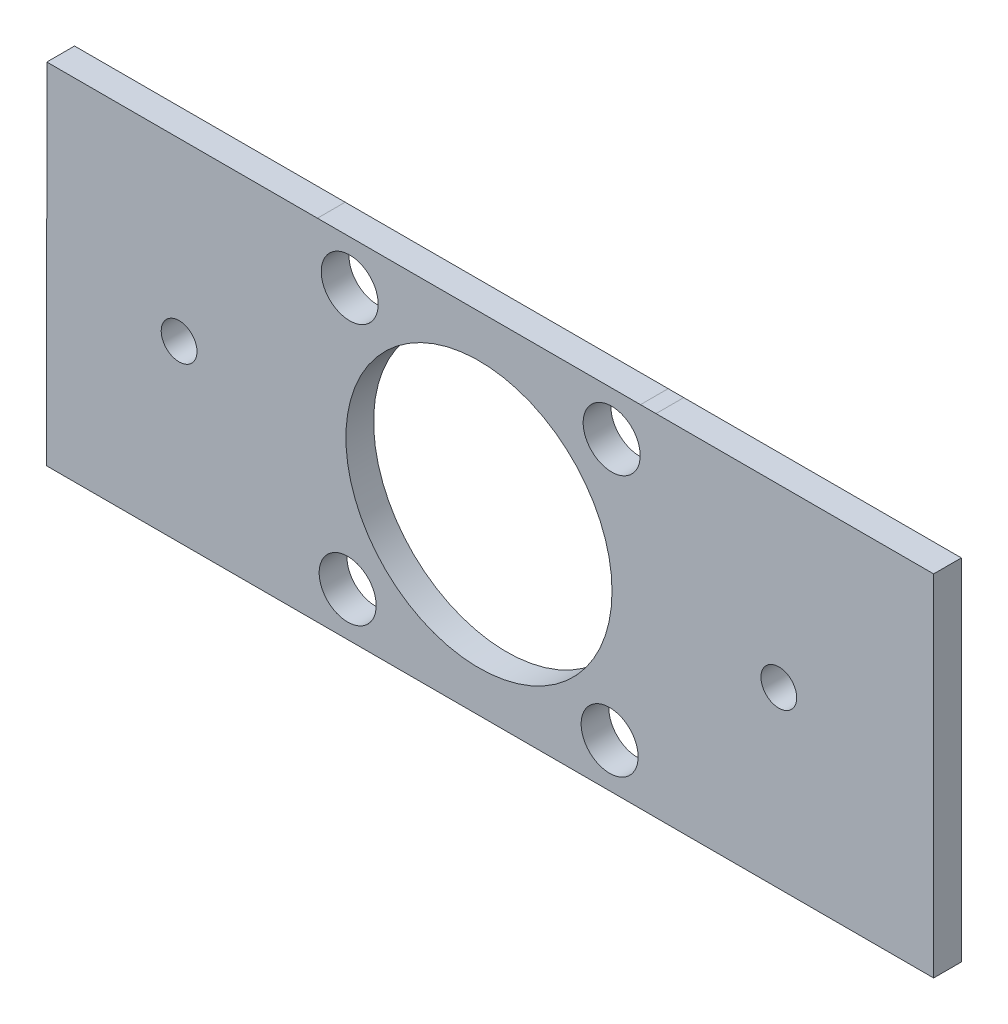
ISO-10303-21;
HEADER;
FILE_DESCRIPTION(('STEP AP214'),'2;1');
FILE_NAME('part.step','',(''),(''),'','','');
FILE_SCHEMA(('AUTOMOTIVE_DESIGN { 1 0 10303 214 1 1 1 1 }'));
ENDSEC;
DATA;
#1=APPLICATION_CONTEXT('core data for automotive mechanical design processes');
#2=APPLICATION_PROTOCOL_DEFINITION('international standard','automotive_design',2000,#1);
#3=PRODUCT_CONTEXT('',#1,'mechanical');
#4=PRODUCT('Part','Part','',(#3));
#5=PRODUCT_RELATED_PRODUCT_CATEGORY('part','',(#4));
#6=PRODUCT_DEFINITION_FORMATION('','',#4);
#7=PRODUCT_DEFINITION_CONTEXT('part definition',#1,'design');
#8=PRODUCT_DEFINITION('design','',#6,#7);
#9=PRODUCT_DEFINITION_SHAPE('','',#8);
#10=(LENGTH_UNIT() NAMED_UNIT(*) SI_UNIT(.MILLI.,.METRE.));
#11=(NAMED_UNIT(*) PLANE_ANGLE_UNIT() SI_UNIT($,.RADIAN.));
#12=(NAMED_UNIT(*) SI_UNIT($,.STERADIAN.) SOLID_ANGLE_UNIT());
#13=UNCERTAINTY_MEASURE_WITH_UNIT(LENGTH_MEASURE(1.E-05),#10,'distance_accuracy_value','');
#14=(GEOMETRIC_REPRESENTATION_CONTEXT(3) GLOBAL_UNCERTAINTY_ASSIGNED_CONTEXT((#13)) GLOBAL_UNIT_ASSIGNED_CONTEXT((#10,
#11,#12)) REPRESENTATION_CONTEXT('',''));
#15=CARTESIAN_POINT('',(0.,0.,0.));
#16=DIRECTION('',(0.,0.,1.));
#17=DIRECTION('',(1.,0.,0.));
#18=AXIS2_PLACEMENT_3D('',#15,#16,#17);
#19=CARTESIAN_POINT('',(-0.0037218528471059,19.9531304687341,-3.175));
#20=DIRECTION('',(-0.000186529767255822,0.999999982603323,0.));
#21=DIRECTION('',(-0.999999982603323,-0.000186529767255822,0.));
#22=AXIS2_PLACEMENT_3D('',#19,#20,#21);
#23=PLANE('',#22);
#24=DIRECTION('',(-0.999999982603323,-0.000186529767255822,0.));
#25=VECTOR('',#24,1.);
#26=CARTESIAN_POINT('',(-0.0037218528471059,19.9531304687341,0.));
#27=LINE('',#26,#25);
#28=CARTESIAN_POINT('',(14.0067908179486,19.9557438464472,0.));
#29=VERTEX_POINT('',#28);
#30=CARTESIAN_POINT('',(-16.9853476234048,19.9499628899764,0.));
#31=VERTEX_POINT('',#30);
#32=EDGE_CURVE('E160',#29,#31,#27,.T.);
#33=ORIENTED_EDGE('',*,*,#32,.F.);
#34=DIRECTION('',(0.,0.,1.));
#35=VECTOR('',#34,1.);
#36=CARTESIAN_POINT('',(14.0067908179486,19.9557438464472,-3.175));
#37=LINE('',#36,#35);
#38=CARTESIAN_POINT('',(14.0067908179486,19.9557438464472,-3.175));
#39=VERTEX_POINT('',#38);
#40=EDGE_CURVE('E11',#39,#29,#37,.T.);
#41=ORIENTED_EDGE('',*,*,#40,.F.);
#42=DIRECTION('',(-0.999999982603323,-0.000186529767255822,0.));
#43=VECTOR('',#42,1.);
#44=CARTESIAN_POINT('',(-0.0037218528471059,19.9531304687341,-3.175));
#45=LINE('',#44,#43);
#46=CARTESIAN_POINT('',(-16.9853476234048,19.9499628899764,-3.175));
#47=VERTEX_POINT('',#46);
#48=EDGE_CURVE('E200',#39,#47,#45,.T.);
#49=ORIENTED_EDGE('',*,*,#48,.T.);
#50=DIRECTION('',(0.,0.,1.));
#51=VECTOR('',#50,1.);
#52=CARTESIAN_POINT('',(-16.9853476234048,19.9499628899764,-3.175));
#53=LINE('',#52,#51);
#54=EDGE_CURVE('E39',#47,#31,#53,.T.);
#55=ORIENTED_EDGE('',*,*,#54,.T.);
#56=EDGE_LOOP('',(#33,#41,#49,#55));
#57=FACE_BOUND('',#56,.T.);
#58=ADVANCED_FACE('F35',(#57),#23,.T.);
#59=CARTESIAN_POINT('',(-0.00343301341673189,19.9533333576571,-3.175));
#60=DIRECTION('',(-0.000172052123040513,0.999999985199033,0.));
#61=DIRECTION('',(-0.999999985199033,-0.000172052123040513,0.));
#62=AXIS2_PLACEMENT_3D('',#59,#60,#61);
#63=PLANE('',#62);
#64=DIRECTION('',(-0.999999985199033,-0.000172052123040513,0.));
#65=VECTOR('',#64,1.);
#66=CARTESIAN_POINT('',(-0.00343301341673189,19.9533333576571,0.));
#67=LINE('',#66,#65);
#68=CARTESIAN_POINT('',(51.0026636627298,19.9621090650081,0.));
#69=VERTEX_POINT('',#68);
#70=EDGE_CURVE('E184',#69,#29,#67,.T.);
#71=ORIENTED_EDGE('',*,*,#70,.F.);
#72=DIRECTION('',(0.,0.,1.));
#73=VECTOR('',#72,1.);
#74=CARTESIAN_POINT('',(51.0026636627298,19.9621090650081,-3.175));
#75=LINE('',#74,#73);
#76=CARTESIAN_POINT('',(51.0026636627298,19.9621090650081,-3.175));
#77=VERTEX_POINT('',#76);
#78=EDGE_CURVE('E45',#77,#69,#75,.T.);
#79=ORIENTED_EDGE('',*,*,#78,.F.);
#80=DIRECTION('',(-0.999999985199033,-0.000172052123040513,0.));
#81=VECTOR('',#80,1.);
#82=CARTESIAN_POINT('',(-0.00343301341673189,19.9533333576571,-3.175));
#83=LINE('',#82,#81);
#84=EDGE_CURVE('E139',#77,#39,#83,.T.);
#85=ORIENTED_EDGE('',*,*,#84,.T.);
#86=ORIENTED_EDGE('',*,*,#40,.T.);
#87=EDGE_LOOP('',(#71,#79,#85,#86));
#88=FACE_BOUND('',#87,.T.);
#89=ADVANCED_FACE('F204',(#88),#63,.T.);
#90=CARTESIAN_POINT('',(0.000811345426152655,19.9641817830415,-3.175));
#91=DIRECTION('',(4.06400539876789E-05,0.999999999174193,0.));
#92=DIRECTION('',(-0.999999999174193,4.06400539876789E-05,0.));
#93=AXIS2_PLACEMENT_3D('',#90,#91,#92);
#94=PLANE('',#93);
#95=DIRECTION('',(-0.999999999174193,4.06400539876789E-05,0.));
#96=VECTOR('',#95,1.);
#97=CARTESIAN_POINT('',(0.000811345426152655,19.9641817830415,0.));
#98=LINE('',#97,#96);
#99=CARTESIAN_POINT('',(52.7806636627298,19.962036806992,0.));
#100=VERTEX_POINT('',#99);
#101=EDGE_CURVE('E123',#100,#69,#98,.T.);
#102=ORIENTED_EDGE('',*,*,#101,.F.);
#103=DIRECTION('',(0.,0.,1.));
#104=VECTOR('',#103,1.);
#105=CARTESIAN_POINT('',(52.7806636627298,19.962036806992,-3.175));
#106=LINE('',#105,#104);
#107=CARTESIAN_POINT('',(52.7806636627298,19.962036806992,-3.175));
#108=VERTEX_POINT('',#107);
#109=EDGE_CURVE('E117',#108,#100,#106,.T.);
#110=ORIENTED_EDGE('',*,*,#109,.F.);
#111=DIRECTION('',(-0.999999999174193,4.06400539876789E-05,0.));
#112=VECTOR('',#111,1.);
#113=CARTESIAN_POINT('',(0.000811345426152655,19.9641817830415,-3.175));
#114=LINE('',#113,#112);
#115=EDGE_CURVE('E121',#108,#77,#114,.T.);
#116=ORIENTED_EDGE('',*,*,#115,.T.);
#117=ORIENTED_EDGE('',*,*,#78,.T.);
#118=EDGE_LOOP('',(#102,#110,#116,#117));
#119=FACE_BOUND('',#118,.T.);
#120=ADVANCED_FACE('F119',(#119),#94,.T.);
#121=CARTESIAN_POINT('',(0.,19.962036806992,-3.175));
#122=DIRECTION('',(0.,-1.,0.));
#123=DIRECTION('',(0.,0.,-1.));
#124=AXIS2_PLACEMENT_3D('',#121,#122,#123);
#125=PLANE('',#124);
#126=DIRECTION('',(1.,0.,0.));
#127=VECTOR('',#126,1.);
#128=CARTESIAN_POINT('',(0.,19.962036806992,0.));
#129=LINE('',#128,#127);
#130=CARTESIAN_POINT('',(84.5747272403392,19.962036806992,0.));
#131=VERTEX_POINT('',#130);
#132=EDGE_CURVE('E181',#100,#131,#129,.T.);
#133=ORIENTED_EDGE('',*,*,#132,.T.);
#134=DIRECTION('',(0.,0.,1.));
#135=VECTOR('',#134,1.);
#136=CARTESIAN_POINT('',(84.5747272403392,19.962036806992,-3.175));
#137=LINE('',#136,#135);
#138=CARTESIAN_POINT('',(84.5747272403392,19.962036806992,-3.175));
#139=VERTEX_POINT('',#138);
#140=EDGE_CURVE('E127',#139,#131,#137,.T.);
#141=ORIENTED_EDGE('',*,*,#140,.F.);
#142=DIRECTION('',(1.,0.,0.));
#143=VECTOR('',#142,1.);
#144=CARTESIAN_POINT('',(0.,19.962036806992,-3.175));
#145=LINE('',#144,#143);
#146=EDGE_CURVE('E131',#108,#139,#145,.T.);
#147=ORIENTED_EDGE('',*,*,#146,.F.);
#148=ORIENTED_EDGE('',*,*,#109,.T.);
#149=EDGE_LOOP('',(#133,#141,#147,#148));
#150=FACE_BOUND('',#149,.T.);
#151=ADVANCED_FACE('F132',(#150),#125,.F.);
#152=CARTESIAN_POINT('',(84.5747272403392,0.,-3.175));
#153=DIRECTION('',(-1.,0.,0.));
#154=DIRECTION('',(0.,0.,1.));
#155=AXIS2_PLACEMENT_3D('',#152,#153,#154);
#156=PLANE('',#155);
#157=DIRECTION('',(0.,-1.,0.));
#158=VECTOR('',#157,1.);
#159=CARTESIAN_POINT('',(84.5747272403392,0.,0.));
#160=LINE('',#159,#158);
#161=CARTESIAN_POINT('',(84.5747272403392,-20.1175245709331,0.));
#162=VERTEX_POINT('',#161);
#163=EDGE_CURVE('E178',#131,#162,#160,.T.);
#164=ORIENTED_EDGE('',*,*,#163,.T.);
#165=DIRECTION('',(0.,0.,1.));
#166=VECTOR('',#165,1.);
#167=CARTESIAN_POINT('',(84.5747272403392,-20.1175245709331,-3.175));
#168=LINE('',#167,#166);
#169=CARTESIAN_POINT('',(84.5747272403392,-20.1175245709331,-3.175));
#170=VERTEX_POINT('',#169);
#171=EDGE_CURVE('E190',#170,#162,#168,.T.);
#172=ORIENTED_EDGE('',*,*,#171,.F.);
#173=DIRECTION('',(0.,-1.,0.));
#174=VECTOR('',#173,1.);
#175=CARTESIAN_POINT('',(84.5747272403392,0.,-3.175));
#176=LINE('',#175,#174);
#177=EDGE_CURVE('E136',#139,#170,#176,.T.);
#178=ORIENTED_EDGE('',*,*,#177,.F.);
#179=ORIENTED_EDGE('',*,*,#140,.T.);
#180=EDGE_LOOP('',(#164,#172,#178,#179));
#181=FACE_BOUND('',#180,.T.);
#182=ADVANCED_FACE('F218',(#181),#156,.F.);
#183=CARTESIAN_POINT('',(0.,-20.1175245709331,-3.175));
#184=DIRECTION('',(0.,1.,0.));
#185=DIRECTION('',(-1.,0.,0.));
#186=AXIS2_PLACEMENT_3D('',#183,#184,#185);
#187=PLANE('',#186);
#188=DIRECTION('',(-1.,0.,0.));
#189=VECTOR('',#188,1.);
#190=CARTESIAN_POINT('',(0.,-20.1175245709331,0.));
#191=LINE('',#190,#189);
#192=CARTESIAN_POINT('',(52.8004414413147,-20.1175245709331,0.));
#193=VERTEX_POINT('',#192);
#194=EDGE_CURVE('E175',#162,#193,#191,.T.);
#195=ORIENTED_EDGE('',*,*,#194,.T.);
#196=DIRECTION('',(0.,0.,1.));
#197=VECTOR('',#196,1.);
#198=CARTESIAN_POINT('',(52.8004414413147,-20.1175245709331,-3.175));
#199=LINE('',#198,#197);
#200=CARTESIAN_POINT('',(52.8004414413147,-20.1175245709331,-3.175));
#201=VERTEX_POINT('',#200);
#202=EDGE_CURVE('E193',#201,#193,#199,.T.);
#203=ORIENTED_EDGE('',*,*,#202,.F.);
#204=DIRECTION('',(-1.,0.,0.));
#205=VECTOR('',#204,1.);
#206=CARTESIAN_POINT('',(0.,-20.1175245709331,-3.175));
#207=LINE('',#206,#205);
#208=EDGE_CURVE('E326',#170,#201,#207,.T.);
#209=ORIENTED_EDGE('',*,*,#208,.F.);
#210=ORIENTED_EDGE('',*,*,#171,.T.);
#211=EDGE_LOOP('',(#195,#203,#209,#210));
#212=FACE_BOUND('',#211,.T.);
#213=ADVANCED_FACE('F221',(#212),#187,.F.);
#214=CARTESIAN_POINT('',(-0.0747562626843128,-19.9190841132001,-3.175));
#215=DIRECTION('',(-0.00375297055801191,-0.999992957581197,0.));
#216=DIRECTION('',(0.999992957581198,-0.00375297055801191,0.));
#217=AXIS2_PLACEMENT_3D('',#214,#215,#216);
#218=PLANE('',#217);
#219=DIRECTION('',(0.999992957581198,-0.00375297055801191,0.));
#220=VECTOR('',#219,1.);
#221=CARTESIAN_POINT('',(-0.0747562626843128,-19.9190841132001,0.));
#222=LINE('',#221,#220);
#223=CARTESIAN_POINT('',(51.0224414413147,-20.1108517422881,0.));
#224=VERTEX_POINT('',#223);
#225=EDGE_CURVE('E172',#224,#193,#222,.T.);
#226=ORIENTED_EDGE('',*,*,#225,.F.);
#227=DIRECTION('',(0.,0.,1.));
#228=VECTOR('',#227,1.);
#229=CARTESIAN_POINT('',(51.0224414413147,-20.1108517422881,-3.175));
#230=LINE('',#229,#228);
#231=CARTESIAN_POINT('',(51.0224414413147,-20.1108517422881,-3.175));
#232=VERTEX_POINT('',#231);
#233=EDGE_CURVE('E195',#232,#224,#230,.T.);
#234=ORIENTED_EDGE('',*,*,#233,.F.);
#235=DIRECTION('',(0.999992957581198,-0.00375297055801191,0.));
#236=VECTOR('',#235,1.);
#237=CARTESIAN_POINT('',(-0.0747562626843128,-19.9190841132001,-3.175));
#238=LINE('',#237,#236);
#239=EDGE_CURVE('E323',#232,#201,#238,.T.);
#240=ORIENTED_EDGE('',*,*,#239,.T.);
#241=ORIENTED_EDGE('',*,*,#202,.T.);
#242=EDGE_LOOP('',(#226,#234,#240,#241));
#243=FACE_BOUND('',#242,.T.);
#244=ADVANCED_FACE('F225',(#243),#218,.T.);
#245=CARTESIAN_POINT('',(0.,-20.1108517422881,-3.175));
#246=DIRECTION('',(0.,-1.,0.));
#247=DIRECTION('',(1.,0.,0.));
#248=AXIS2_PLACEMENT_3D('',#245,#246,#247);
#249=PLANE('',#248);
#250=DIRECTION('',(1.,0.,0.));
#251=VECTOR('',#250,1.);
#252=CARTESIAN_POINT('',(0.,-20.1108517422881,0.));
#253=LINE('',#252,#251);
#254=CARTESIAN_POINT('',(13.9870130393637,-20.1108517422881,0.));
#255=VERTEX_POINT('',#254);
#256=EDGE_CURVE('E169',#255,#224,#253,.T.);
#257=ORIENTED_EDGE('',*,*,#256,.F.);
#258=DIRECTION('',(0.,0.,1.));
#259=VECTOR('',#258,1.);
#260=CARTESIAN_POINT('',(13.9870130393637,-20.1108517422881,-3.175));
#261=LINE('',#260,#259);
#262=CARTESIAN_POINT('',(13.9870130393637,-20.1108517422881,-3.175));
#263=VERTEX_POINT('',#262);
#264=EDGE_CURVE('E197',#263,#255,#261,.T.);
#265=ORIENTED_EDGE('',*,*,#264,.F.);
#266=DIRECTION('',(1.,0.,0.));
#267=VECTOR('',#266,1.);
#268=CARTESIAN_POINT('',(0.,-20.1108517422881,-3.175));
#269=LINE('',#268,#267);
#270=EDGE_CURVE('E320',#263,#232,#269,.T.);
#271=ORIENTED_EDGE('',*,*,#270,.T.);
#272=ORIENTED_EDGE('',*,*,#233,.T.);
#273=EDGE_LOOP('',(#257,#265,#271,#272));
#274=FACE_BOUND('',#273,.T.);
#275=ADVANCED_FACE('F229',(#274),#249,.T.);
#276=CARTESIAN_POINT('',(0.00316795026482087,-20.1130542981554,-3.175));
#277=DIRECTION('',(0.000157507168158709,-0.999999987595746,0.));
#278=DIRECTION('',(0.999999987595746,0.000157507168158709,0.));
#279=AXIS2_PLACEMENT_3D('',#276,#277,#278);
#280=PLANE('',#279);
#281=DIRECTION('',(0.999999987595746,0.000157507168158709,0.));
#282=VECTOR('',#281,1.);
#283=CARTESIAN_POINT('',(0.00316795026482087,-20.1130542981554,0.));
#284=LINE('',#283,#282);
#285=CARTESIAN_POINT('',(-17.0051251854754,-20.1157332262756,0.));
#286=VERTEX_POINT('',#285);
#287=EDGE_CURVE('E166',#286,#255,#284,.T.);
#288=ORIENTED_EDGE('',*,*,#287,.F.);
#289=DIRECTION('',(0.,0.,1.));
#290=VECTOR('',#289,1.);
#291=CARTESIAN_POINT('',(-17.0051251854754,-20.1157332262756,-3.175));
#292=LINE('',#291,#290);
#293=CARTESIAN_POINT('',(-17.0051251854754,-20.1157332262756,-3.175));
#294=VERTEX_POINT('',#293);
#295=EDGE_CURVE('E198',#294,#286,#292,.T.);
#296=ORIENTED_EDGE('',*,*,#295,.F.);
#297=DIRECTION('',(0.999999987595746,0.000157507168158709,0.));
#298=VECTOR('',#297,1.);
#299=CARTESIAN_POINT('',(0.00316795026482087,-20.1130542981554,-3.175));
#300=LINE('',#299,#298);
#301=EDGE_CURVE('E317',#294,#263,#300,.T.);
#302=ORIENTED_EDGE('',*,*,#301,.T.);
#303=ORIENTED_EDGE('',*,*,#264,.T.);
#304=EDGE_LOOP('',(#288,#296,#302,#303));
#305=FACE_BOUND('',#304,.T.);
#306=ADVANCED_FACE('F233',(#305),#280,.T.);
#307=CARTESIAN_POINT('',(17.7032245460716,14.8903497507451,-3.175));
#308=DIRECTION('',(0.,0.,1.));
#309=DIRECTION('',(1.,0.,0.));
#310=AXIS2_PLACEMENT_3D('',#307,#308,#309);
#311=CYLINDRICAL_SURFACE('',#310,3.26389999999998);
#312=CARTESIAN_POINT('',(17.7032245460716,14.8903497507451,-3.175));
#313=DIRECTION('',(0.,0.,1.));
#314=DIRECTION('',(1.,0.,0.));
#315=AXIS2_PLACEMENT_3D('',#312,#313,#314);
#316=CIRCLE('',#315,3.26389999999998);
#317=CARTESIAN_POINT('',(20.9671245460716,14.8903497507451,-3.175));
#318=VERTEX_POINT('',#317);
#319=EDGE_CURVE('E311',#318,#318,#316,.T.);
#320=ORIENTED_EDGE('',*,*,#319,.F.);
#321=EDGE_LOOP('',(#320));
#322=FACE_BOUND('',#321,.T.);
#323=CARTESIAN_POINT('',(17.7032245460716,14.8903497507451,0.));
#324=DIRECTION('',(0.,0.,1.));
#325=DIRECTION('',(1.,0.,0.));
#326=AXIS2_PLACEMENT_3D('',#323,#324,#325);
#327=CIRCLE('',#326,3.26389999999998);
#328=CARTESIAN_POINT('',(20.9671245460716,14.8903497507451,0.));
#329=VERTEX_POINT('',#328);
#330=EDGE_CURVE('E157',#329,#329,#327,.T.);
#331=ORIENTED_EDGE('',*,*,#330,.T.);
#332=EDGE_LOOP('',(#331));
#333=FACE_BOUND('',#332,.T.);
#334=ADVANCED_FACE('F237',(#322,#333),#311,.F.);
#335=CARTESIAN_POINT('',(47.7031644296448,14.8929927776785,-3.175));
#336=DIRECTION('',(0.,0.,1.));
#337=DIRECTION('',(1.,0.,0.));
#338=AXIS2_PLACEMENT_3D('',#335,#336,#337);
#339=CYLINDRICAL_SURFACE('',#338,3.26389999999998);
#340=CARTESIAN_POINT('',(47.7031644296448,14.8929927776785,-3.175));
#341=DIRECTION('',(0.,0.,1.));
#342=DIRECTION('',(1.,0.,0.));
#343=AXIS2_PLACEMENT_3D('',#340,#341,#342);
#344=CIRCLE('',#343,3.26389999999998);
#345=CARTESIAN_POINT('',(50.9670644296448,14.8929927776785,-3.175));
#346=VERTEX_POINT('',#345);
#347=EDGE_CURVE('E308',#346,#346,#344,.T.);
#348=ORIENTED_EDGE('',*,*,#347,.F.);
#349=EDGE_LOOP('',(#348));
#350=FACE_BOUND('',#349,.T.);
#351=CARTESIAN_POINT('',(47.7031644296448,14.8929927776785,0.));
#352=DIRECTION('',(0.,0.,1.));
#353=DIRECTION('',(1.,0.,0.));
#354=AXIS2_PLACEMENT_3D('',#351,#352,#353);
#355=CIRCLE('',#354,3.26389999999998);
#356=CARTESIAN_POINT('',(50.9670644296448,14.8929927776785,0.));
#357=VERTEX_POINT('',#356);
#358=EDGE_CURVE('E154',#357,#357,#355,.T.);
#359=ORIENTED_EDGE('',*,*,#358,.T.);
#360=EDGE_LOOP('',(#359));
#361=FACE_BOUND('',#360,.T.);
#362=ADVANCED_FACE('F243',(#350,#361),#339,.F.);
#363=CARTESIAN_POINT('',(17.4693070325316,-15.1071914929735,-3.175));
#364=DIRECTION('',(0.,0.,1.));
#365=DIRECTION('',(1.,0.,0.));
#366=AXIS2_PLACEMENT_3D('',#363,#364,#365);
#367=CYLINDRICAL_SURFACE('',#366,3.26389999999998);
#368=CARTESIAN_POINT('',(17.4693070325316,-15.1071914929735,-3.175));
#369=DIRECTION('',(0.,0.,1.));
#370=DIRECTION('',(1.,0.,0.));
#371=AXIS2_PLACEMENT_3D('',#368,#369,#370);
#372=CIRCLE('',#371,3.26389999999998);
#373=CARTESIAN_POINT('',(20.7332070325316,-15.1071914929735,-3.175));
#374=VERTEX_POINT('',#373);
#375=EDGE_CURVE('E305',#374,#374,#372,.T.);
#376=ORIENTED_EDGE('',*,*,#375,.F.);
#377=EDGE_LOOP('',(#376));
#378=FACE_BOUND('',#377,.T.);
#379=CARTESIAN_POINT('',(17.4693070325316,-15.1071914929735,0.));
#380=DIRECTION('',(0.,0.,1.));
#381=DIRECTION('',(1.,0.,0.));
#382=AXIS2_PLACEMENT_3D('',#379,#380,#381);
#383=CIRCLE('',#382,3.26389999999998);
#384=CARTESIAN_POINT('',(20.7332070325316,-15.1071914929735,0.));
#385=VERTEX_POINT('',#384);
#386=EDGE_CURVE('E151',#385,#385,#383,.T.);
#387=ORIENTED_EDGE('',*,*,#386,.T.);
#388=EDGE_LOOP('',(#387));
#389=FACE_BOUND('',#388,.T.);
#390=ADVANCED_FACE('F247',(#378,#389),#367,.F.);
#391=CARTESIAN_POINT('',(47.46924701025,-15.1060352506511,-3.175));
#392=DIRECTION('',(0.,0.,1.));
#393=DIRECTION('',(1.,0.,0.));
#394=AXIS2_PLACEMENT_3D('',#391,#392,#393);
#395=CYLINDRICAL_SURFACE('',#394,3.26389999999997);
#396=CARTESIAN_POINT('',(47.46924701025,-15.1060352506511,-3.175));
#397=DIRECTION('',(0.,0.,1.));
#398=DIRECTION('',(1.,0.,0.));
#399=AXIS2_PLACEMENT_3D('',#396,#397,#398);
#400=CIRCLE('',#399,3.26389999999997);
#401=CARTESIAN_POINT('',(50.73314701025,-15.1060352506511,-3.175));
#402=VERTEX_POINT('',#401);
#403=EDGE_CURVE('E261',#402,#402,#400,.T.);
#404=ORIENTED_EDGE('',*,*,#403,.F.);
#405=EDGE_LOOP('',(#404));
#406=FACE_BOUND('',#405,.T.);
#407=CARTESIAN_POINT('',(47.46924701025,-15.1060352506511,0.));
#408=DIRECTION('',(0.,0.,1.));
#409=DIRECTION('',(1.,0.,0.));
#410=AXIS2_PLACEMENT_3D('',#407,#408,#409);
#411=CIRCLE('',#410,3.26389999999997);
#412=CARTESIAN_POINT('',(50.73314701025,-15.1060352506511,0.));
#413=VERTEX_POINT('',#412);
#414=EDGE_CURVE('E147',#413,#413,#411,.T.);
#415=ORIENTED_EDGE('',*,*,#414,.T.);
#416=EDGE_LOOP('',(#415));
#417=FACE_BOUND('',#416,.T.);
#418=ADVANCED_FACE('F250',(#406,#417),#395,.F.);
#419=CARTESIAN_POINT('',(32.5047272403392,-0.168751445760855,-3.175));
#420=DIRECTION('',(0.,0.,1.));
#421=DIRECTION('',(1.,0.,0.));
#422=AXIS2_PLACEMENT_3D('',#419,#420,#421);
#423=CYLINDRICAL_SURFACE('',#422,15.24);
#424=CARTESIAN_POINT('',(32.5047272403392,-0.168751445760855,-3.175));
#425=DIRECTION('',(0.,0.,1.));
#426=DIRECTION('',(1.,0.,0.));
#427=AXIS2_PLACEMENT_3D('',#424,#425,#426);
#428=CIRCLE('',#427,15.24);
#429=CARTESIAN_POINT('',(47.7447272403392,-0.168751445760855,-3.175));
#430=VERTEX_POINT('',#429);
#431=EDGE_CURVE('E186',#430,#430,#428,.T.);
#432=ORIENTED_EDGE('',*,*,#431,.F.);
#433=EDGE_LOOP('',(#432));
#434=FACE_BOUND('',#433,.T.);
#435=CARTESIAN_POINT('',(32.5047272403392,-0.168751445760855,0.));
#436=DIRECTION('',(0.,0.,1.));
#437=DIRECTION('',(1.,0.,0.));
#438=AXIS2_PLACEMENT_3D('',#435,#436,#437);
#439=CIRCLE('',#438,15.24);
#440=CARTESIAN_POINT('',(47.7447272403392,-0.168751445760855,0.));
#441=VERTEX_POINT('',#440);
#442=EDGE_CURVE('E144',#441,#441,#439,.T.);
#443=ORIENTED_EDGE('',*,*,#442,.T.);
#444=EDGE_LOOP('',(#443));
#445=FACE_BOUND('',#444,.T.);
#446=ADVANCED_FACE('F37',(#434,#445),#423,.F.);
#447=CARTESIAN_POINT('',(-16.9951913487744,0.00838930767176718,-3.175));
#448=DIRECTION('',(-0.999999878165565,0.000493628255045544,0.));
#449=DIRECTION('',(-0.000493628255045544,-0.999999878165565,0.));
#450=AXIS2_PLACEMENT_3D('',#447,#448,#449);
#451=PLANE('',#450);
#452=DIRECTION('',(-0.000493628255045544,-0.999999878165566,0.));
#453=VECTOR('',#452,1.);
#454=CARTESIAN_POINT('',(-16.9951913487744,0.00838930767176718,0.));
#455=LINE('',#454,#453);
#456=EDGE_CURVE('E163',#31,#286,#455,.T.);
#457=ORIENTED_EDGE('',*,*,#456,.F.);
#458=ORIENTED_EDGE('',*,*,#54,.F.);
#459=DIRECTION('',(-0.000493628255045544,-0.999999878165566,0.));
#460=VECTOR('',#459,1.);
#461=CARTESIAN_POINT('',(-16.9951913487744,0.00838930767176718,-3.175));
#462=LINE('',#461,#460);
#463=EDGE_CURVE('E315',#47,#294,#462,.T.);
#464=ORIENTED_EDGE('',*,*,#463,.T.);
#465=ORIENTED_EDGE('',*,*,#295,.T.);
#466=EDGE_LOOP('',(#457,#458,#464,#465));
#467=FACE_BOUND('',#466,.T.);
#468=ADVANCED_FACE('F201',(#467),#451,.T.);
#469=CARTESIAN_POINT('',(0.,0.,-3.175));
#470=DIRECTION('',(0.,0.,1.));
#471=DIRECTION('',(1.,0.,0.));
#472=AXIS2_PLACEMENT_3D('',#469,#470,#471);
#473=PLANE('',#472);
#474=CARTESIAN_POINT('',(-1.83562727891415,-0.168751445760852,-3.175));
#475=DIRECTION('',(0.,0.,-1.));
#476=DIRECTION('',(-1.,0.,0.));
#477=AXIS2_PLACEMENT_3D('',#474,#475,#476);
#478=CIRCLE('',#477,2.04966570165475);
#479=CARTESIAN_POINT('',(-3.88529298056889,-0.168751445760852,-3.175));
#480=VERTEX_POINT('',#479);
#481=EDGE_CURVE('E293',#480,#480,#478,.T.);
#482=ORIENTED_EDGE('',*,*,#481,.F.);
#483=EDGE_LOOP('',(#482));
#484=FACE_BOUND('',#483,.T.);
#485=CARTESIAN_POINT('',(66.8450817595926,-0.168751445760852,-3.175));
#486=DIRECTION('',(0.,0.,-1.));
#487=DIRECTION('',(-1.,0.,0.));
#488=AXIS2_PLACEMENT_3D('',#485,#486,#487);
#489=CIRCLE('',#488,2.04966570165475);
#490=CARTESIAN_POINT('',(64.7954160579378,-0.168751445760852,-3.175));
#491=VERTEX_POINT('',#490);
#492=EDGE_CURVE('E294',#491,#491,#489,.T.);
#493=ORIENTED_EDGE('',*,*,#492,.F.);
#494=EDGE_LOOP('',(#493));
#495=FACE_BOUND('',#494,.T.);
#496=ORIENTED_EDGE('',*,*,#431,.T.);
#497=EDGE_LOOP('',(#496));
#498=FACE_BOUND('',#497,.T.);
#499=ORIENTED_EDGE('',*,*,#403,.T.);
#500=EDGE_LOOP('',(#499));
#501=FACE_BOUND('',#500,.T.);
#502=ORIENTED_EDGE('',*,*,#375,.T.);
#503=EDGE_LOOP('',(#502));
#504=FACE_BOUND('',#503,.T.);
#505=ORIENTED_EDGE('',*,*,#347,.T.);
#506=EDGE_LOOP('',(#505));
#507=FACE_BOUND('',#506,.T.);
#508=ORIENTED_EDGE('',*,*,#319,.T.);
#509=EDGE_LOOP('',(#508));
#510=FACE_BOUND('',#509,.T.);
#511=ORIENTED_EDGE('',*,*,#48,.F.);
#512=ORIENTED_EDGE('',*,*,#84,.F.);
#513=ORIENTED_EDGE('',*,*,#115,.F.);
#514=ORIENTED_EDGE('',*,*,#146,.T.);
#515=ORIENTED_EDGE('',*,*,#177,.T.);
#516=ORIENTED_EDGE('',*,*,#208,.T.);
#517=ORIENTED_EDGE('',*,*,#239,.F.);
#518=ORIENTED_EDGE('',*,*,#270,.F.);
#519=ORIENTED_EDGE('',*,*,#301,.F.);
#520=ORIENTED_EDGE('',*,*,#463,.F.);
#521=EDGE_LOOP('',(#511,#512,#513,#514,#515,#516,#517,#518,#519,#520));
#522=FACE_BOUND('',#521,.T.);
#523=ADVANCED_FACE('F138',(#484,#495,#498,#501,#504,#507,#510,#522),#473,.F.);
#524=CARTESIAN_POINT('',(0.,0.,0.));
#525=DIRECTION('',(0.,0.,1.));
#526=DIRECTION('',(1.,0.,0.));
#527=AXIS2_PLACEMENT_3D('',#524,#525,#526);
#528=PLANE('',#527);
#529=CARTESIAN_POINT('',(-1.83562727891415,-0.168751445760852,0.));
#530=DIRECTION('',(0.,0.,-1.));
#531=DIRECTION('',(-1.,0.,0.));
#532=AXIS2_PLACEMENT_3D('',#529,#530,#531);
#533=CIRCLE('',#532,2.04966570165475);
#534=CARTESIAN_POINT('',(-3.88529298056889,-0.168751445760852,0.));
#535=VERTEX_POINT('',#534);
#536=EDGE_CURVE('E148',#535,#535,#533,.T.);
#537=ORIENTED_EDGE('',*,*,#536,.T.);
#538=EDGE_LOOP('',(#537));
#539=FACE_BOUND('',#538,.T.);
#540=CARTESIAN_POINT('',(66.8450817595926,-0.168751445760852,0.));
#541=DIRECTION('',(0.,0.,-1.));
#542=DIRECTION('',(-1.,0.,0.));
#543=AXIS2_PLACEMENT_3D('',#540,#541,#542);
#544=CIRCLE('',#543,2.04966570165475);
#545=CARTESIAN_POINT('',(64.7954160579378,-0.168751445760852,0.));
#546=VERTEX_POINT('',#545);
#547=EDGE_CURVE('E290',#546,#546,#544,.T.);
#548=ORIENTED_EDGE('',*,*,#547,.T.);
#549=EDGE_LOOP('',(#548));
#550=FACE_BOUND('',#549,.T.);
#551=ORIENTED_EDGE('',*,*,#442,.F.);
#552=EDGE_LOOP('',(#551));
#553=FACE_BOUND('',#552,.T.);
#554=ORIENTED_EDGE('',*,*,#414,.F.);
#555=EDGE_LOOP('',(#554));
#556=FACE_BOUND('',#555,.T.);
#557=ORIENTED_EDGE('',*,*,#386,.F.);
#558=EDGE_LOOP('',(#557));
#559=FACE_BOUND('',#558,.T.);
#560=ORIENTED_EDGE('',*,*,#358,.F.);
#561=EDGE_LOOP('',(#560));
#562=FACE_BOUND('',#561,.T.);
#563=ORIENTED_EDGE('',*,*,#330,.F.);
#564=EDGE_LOOP('',(#563));
#565=FACE_BOUND('',#564,.T.);
#566=ORIENTED_EDGE('',*,*,#32,.T.);
#567=ORIENTED_EDGE('',*,*,#456,.T.);
#568=ORIENTED_EDGE('',*,*,#287,.T.);
#569=ORIENTED_EDGE('',*,*,#256,.T.);
#570=ORIENTED_EDGE('',*,*,#225,.T.);
#571=ORIENTED_EDGE('',*,*,#194,.F.);
#572=ORIENTED_EDGE('',*,*,#163,.F.);
#573=ORIENTED_EDGE('',*,*,#132,.F.);
#574=ORIENTED_EDGE('',*,*,#101,.T.);
#575=ORIENTED_EDGE('',*,*,#70,.T.);
#576=EDGE_LOOP('',(#566,#567,#568,#569,#570,#571,#572,#573,#574,#575));
#577=FACE_BOUND('',#576,.T.);
#578=ADVANCED_FACE('F203',(#539,#550,#553,#556,#559,#562,#565,#577),#528,.T.);
#579=CARTESIAN_POINT('',(66.8450817595926,-0.168751445760852,0.));
#580=DIRECTION('',(0.,0.,-1.));
#581=DIRECTION('',(-1.,0.,0.));
#582=AXIS2_PLACEMENT_3D('',#579,#580,#581);
#583=CYLINDRICAL_SURFACE('',#582,2.04966570165475);
#584=ORIENTED_EDGE('',*,*,#547,.F.);
#585=EDGE_LOOP('',(#584));
#586=FACE_BOUND('',#585,.T.);
#587=ORIENTED_EDGE('',*,*,#492,.T.);
#588=EDGE_LOOP('',(#587));
#589=FACE_BOUND('',#588,.T.);
#590=ADVANCED_FACE('F266',(#586,#589),#583,.F.);
#591=CARTESIAN_POINT('',(-1.83562727891415,-0.168751445760852,0.));
#592=DIRECTION('',(0.,0.,-1.));
#593=DIRECTION('',(-1.,0.,0.));
#594=AXIS2_PLACEMENT_3D('',#591,#592,#593);
#595=CYLINDRICAL_SURFACE('',#594,2.04966570165475);
#596=ORIENTED_EDGE('',*,*,#536,.F.);
#597=EDGE_LOOP('',(#596));
#598=FACE_BOUND('',#597,.T.);
#599=ORIENTED_EDGE('',*,*,#481,.T.);
#600=EDGE_LOOP('',(#599));
#601=FACE_BOUND('',#600,.T.);
#602=ADVANCED_FACE('F280',(#598,#601),#595,.F.);
#603=CLOSED_SHELL('',(#58,#89,#120,#151,#182,#213,#244,#275,#306,#334,#362,#390,#418,#446,#468,
#523,#578,#590,#602));
#604=MANIFOLD_SOLID_BREP('B2',#603);
#605=ADVANCED_BREP_SHAPE_REPRESENTATION('',(#18,#604),#14);
#606=SHAPE_DEFINITION_REPRESENTATION(#9,#605);
ENDSEC;
END-ISO-10303-21;
